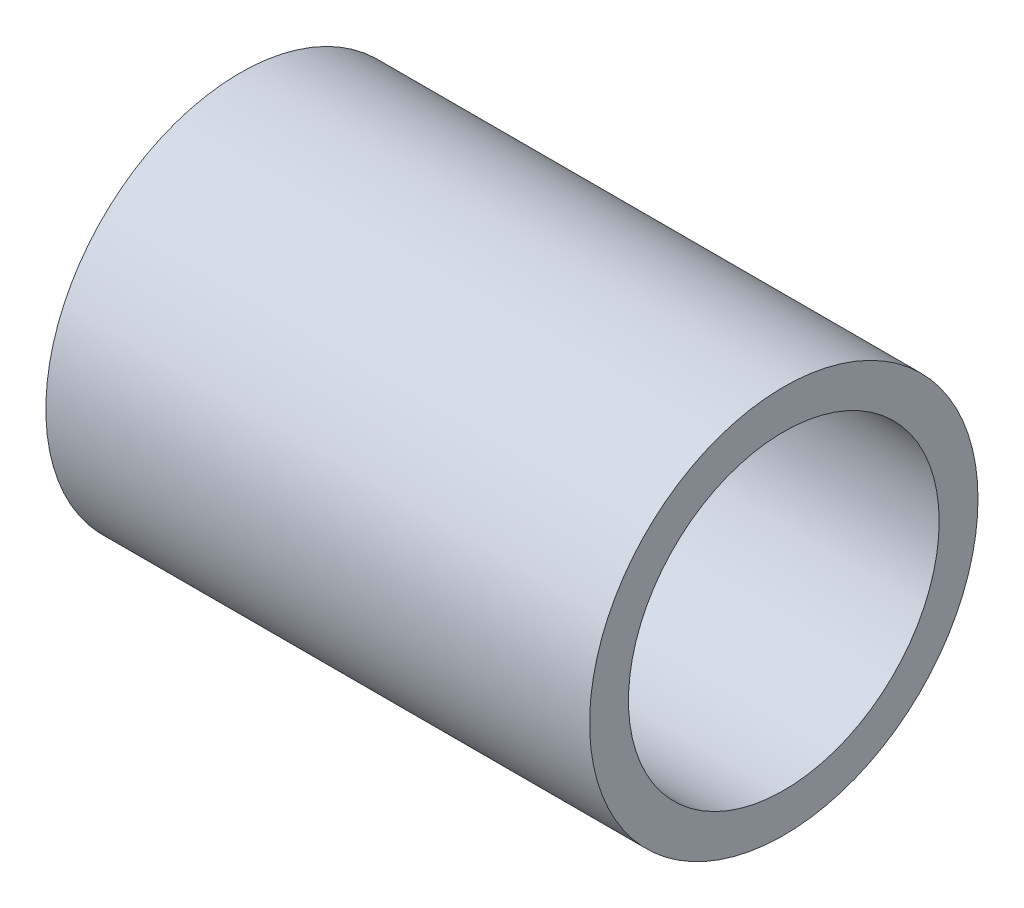
ISO-10303-21;
HEADER;
FILE_DESCRIPTION(('STEP AP214'),'2;1');
FILE_NAME('part.step','',(''),(''),'','','');
FILE_SCHEMA(('AUTOMOTIVE_DESIGN { 1 0 10303 214 1 1 1 1 }'));
ENDSEC;
DATA;
#1=APPLICATION_CONTEXT('core data for automotive mechanical design processes');
#2=APPLICATION_PROTOCOL_DEFINITION('international standard','automotive_design',2000,#1);
#3=PRODUCT_CONTEXT('',#1,'mechanical');
#4=PRODUCT('Part','Part','',(#3));
#5=PRODUCT_RELATED_PRODUCT_CATEGORY('part','',(#4));
#6=PRODUCT_DEFINITION_FORMATION('','',#4);
#7=PRODUCT_DEFINITION_CONTEXT('part definition',#1,'design');
#8=PRODUCT_DEFINITION('design','',#6,#7);
#9=PRODUCT_DEFINITION_SHAPE('','',#8);
#10=(LENGTH_UNIT() NAMED_UNIT(*) SI_UNIT(.MILLI.,.METRE.));
#11=(NAMED_UNIT(*) PLANE_ANGLE_UNIT() SI_UNIT($,.RADIAN.));
#12=(NAMED_UNIT(*) SI_UNIT($,.STERADIAN.) SOLID_ANGLE_UNIT());
#13=UNCERTAINTY_MEASURE_WITH_UNIT(LENGTH_MEASURE(1.E-05),#10,'distance_accuracy_value','');
#14=(GEOMETRIC_REPRESENTATION_CONTEXT(3) GLOBAL_UNCERTAINTY_ASSIGNED_CONTEXT((#13)) GLOBAL_UNIT_ASSIGNED_CONTEXT((#10,
#11,#12)) REPRESENTATION_CONTEXT('',''));
#15=CARTESIAN_POINT('',(0.,0.,0.));
#16=DIRECTION('',(0.,0.,1.));
#17=DIRECTION('',(1.,0.,0.));
#18=AXIS2_PLACEMENT_3D('',#15,#16,#17);
#19=CARTESIAN_POINT('',(7.,0.,0.));
#20=DIRECTION('',(1.,0.,0.));
#21=DIRECTION('',(0.,0.,-1.));
#22=AXIS2_PLACEMENT_3D('',#19,#20,#21);
#23=PLANE('',#22);
#24=CARTESIAN_POINT('',(7.,0.,0.));
#25=DIRECTION('',(1.,0.,0.));
#26=DIRECTION('',(0.,0.,-1.));
#27=AXIS2_PLACEMENT_3D('',#24,#25,#26);
#28=CIRCLE('',#27,2.5);
#29=CARTESIAN_POINT('',(7.,0.,-2.5));
#30=VERTEX_POINT('',#29);
#31=EDGE_CURVE('E10',#30,#30,#28,.T.);
#32=ORIENTED_EDGE('',*,*,#31,.T.);
#33=EDGE_LOOP('',(#32));
#34=FACE_BOUND('',#33,.T.);
#35=CARTESIAN_POINT('',(7.,0.,0.));
#36=DIRECTION('',(1.,0.,0.));
#37=DIRECTION('',(0.,0.,-1.));
#38=AXIS2_PLACEMENT_3D('',#35,#36,#37);
#39=CIRCLE('',#38,2.);
#40=CARTESIAN_POINT('',(7.,0.,-2.));
#41=VERTEX_POINT('',#40);
#42=EDGE_CURVE('E54',#41,#41,#39,.T.);
#43=ORIENTED_EDGE('',*,*,#42,.F.);
#44=EDGE_LOOP('',(#43));
#45=FACE_BOUND('',#44,.T.);
#46=ADVANCED_FACE('F40',(#34,#45),#23,.T.);
#47=CARTESIAN_POINT('',(0.,0.,0.));
#48=DIRECTION('',(1.,0.,0.));
#49=DIRECTION('',(0.,0.,-1.));
#50=AXIS2_PLACEMENT_3D('',#47,#48,#49);
#51=PLANE('',#50);
#52=CARTESIAN_POINT('',(0.,0.,0.));
#53=DIRECTION('',(1.,0.,0.));
#54=DIRECTION('',(0.,0.,-1.));
#55=AXIS2_PLACEMENT_3D('',#52,#53,#54);
#56=CIRCLE('',#55,2.5);
#57=CARTESIAN_POINT('',(0.,0.,-2.5));
#58=VERTEX_POINT('',#57);
#59=EDGE_CURVE('E44',#58,#58,#56,.T.);
#60=ORIENTED_EDGE('',*,*,#59,.F.);
#61=EDGE_LOOP('',(#60));
#62=FACE_BOUND('',#61,.T.);
#63=CARTESIAN_POINT('',(0.,0.,0.));
#64=DIRECTION('',(1.,0.,0.));
#65=DIRECTION('',(0.,0.,-1.));
#66=AXIS2_PLACEMENT_3D('',#63,#64,#65);
#67=CIRCLE('',#66,2.);
#68=CARTESIAN_POINT('',(0.,0.,-2.));
#69=VERTEX_POINT('',#68);
#70=EDGE_CURVE('E56',#69,#69,#67,.T.);
#71=ORIENTED_EDGE('',*,*,#70,.T.);
#72=EDGE_LOOP('',(#71));
#73=FACE_BOUND('',#72,.T.);
#74=ADVANCED_FACE('F69',(#62,#73),#51,.F.);
#75=CARTESIAN_POINT('',(7.,0.,0.));
#76=DIRECTION('',(-1.,0.,0.));
#77=DIRECTION('',(0.,0.,1.));
#78=AXIS2_PLACEMENT_3D('',#75,#76,#77);
#79=CYLINDRICAL_SURFACE('',#78,2.5);
#80=ORIENTED_EDGE('',*,*,#31,.F.);
#81=EDGE_LOOP('',(#80));
#82=FACE_BOUND('',#81,.T.);
#83=ORIENTED_EDGE('',*,*,#59,.T.);
#84=EDGE_LOOP('',(#83));
#85=FACE_BOUND('',#84,.T.);
#86=ADVANCED_FACE('F42',(#82,#85),#79,.T.);
#87=CARTESIAN_POINT('',(7.,0.,0.));
#88=DIRECTION('',(-1.,0.,0.));
#89=DIRECTION('',(0.,0.,1.));
#90=AXIS2_PLACEMENT_3D('',#87,#88,#89);
#91=CYLINDRICAL_SURFACE('',#90,2.);
#92=ORIENTED_EDGE('',*,*,#42,.T.);
#93=EDGE_LOOP('',(#92));
#94=FACE_BOUND('',#93,.T.);
#95=ORIENTED_EDGE('',*,*,#70,.F.);
#96=EDGE_LOOP('',(#95));
#97=FACE_BOUND('',#96,.T.);
#98=ADVANCED_FACE('F65',(#94,#97),#91,.F.);
#99=CLOSED_SHELL('',(#46,#74,#86,#98));
#100=MANIFOLD_SOLID_BREP('B2',#99);
#101=ADVANCED_BREP_SHAPE_REPRESENTATION('',(#18,#100),#14);
#102=SHAPE_DEFINITION_REPRESENTATION(#9,#101);
ENDSEC;
END-ISO-10303-21;
